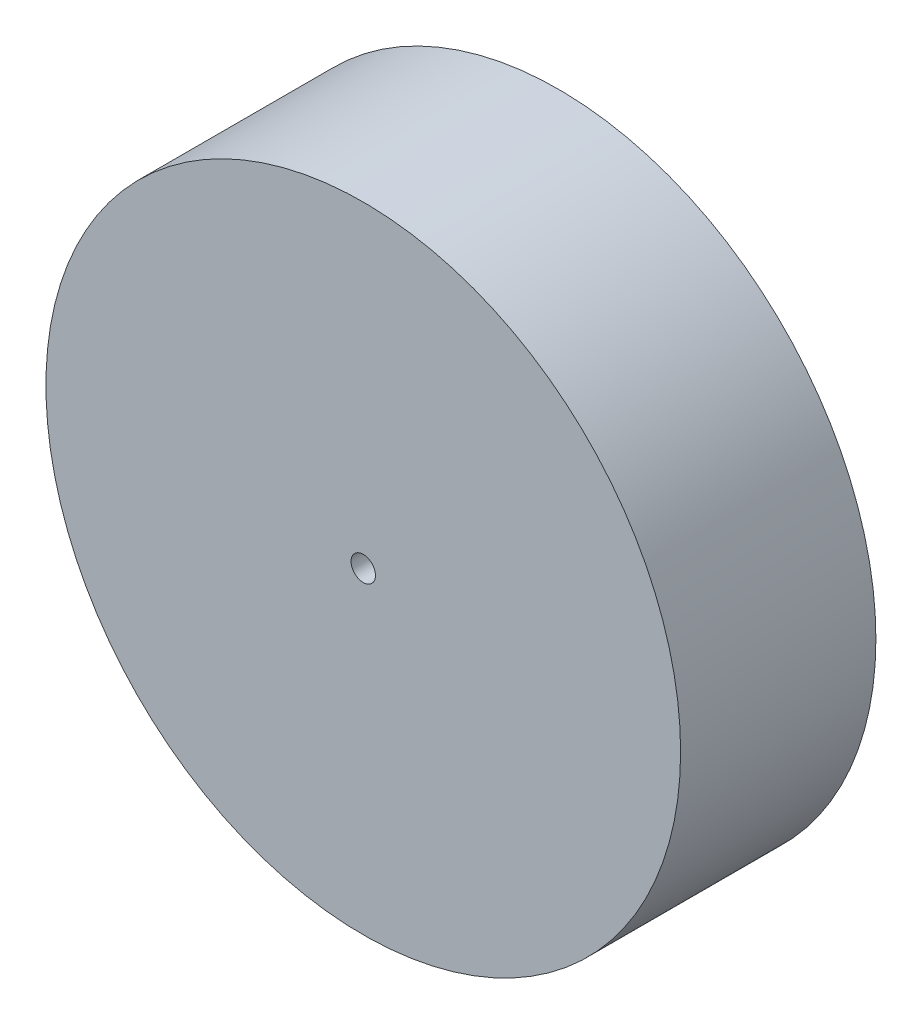
ISO-10303-21;
HEADER;
FILE_DESCRIPTION(('STEP AP214'),'2;1');
FILE_NAME('part.step','',(''),(''),'','','');
FILE_SCHEMA(('AUTOMOTIVE_DESIGN { 1 0 10303 214 1 1 1 1 }'));
ENDSEC;
DATA;
#1=APPLICATION_CONTEXT('core data for automotive mechanical design processes');
#2=APPLICATION_PROTOCOL_DEFINITION('international standard','automotive_design',2000,#1);
#3=PRODUCT_CONTEXT('',#1,'mechanical');
#4=PRODUCT('Part','Part','',(#3));
#5=PRODUCT_RELATED_PRODUCT_CATEGORY('part','',(#4));
#6=PRODUCT_DEFINITION_FORMATION('','',#4);
#7=PRODUCT_DEFINITION_CONTEXT('part definition',#1,'design');
#8=PRODUCT_DEFINITION('design','',#6,#7);
#9=PRODUCT_DEFINITION_SHAPE('','',#8);
#10=(LENGTH_UNIT() NAMED_UNIT(*) SI_UNIT(.MILLI.,.METRE.));
#11=(NAMED_UNIT(*) PLANE_ANGLE_UNIT() SI_UNIT($,.RADIAN.));
#12=(NAMED_UNIT(*) SI_UNIT($,.STERADIAN.) SOLID_ANGLE_UNIT());
#13=UNCERTAINTY_MEASURE_WITH_UNIT(LENGTH_MEASURE(1.E-05),#10,'distance_accuracy_value','');
#14=(GEOMETRIC_REPRESENTATION_CONTEXT(3) GLOBAL_UNCERTAINTY_ASSIGNED_CONTEXT((#13)) GLOBAL_UNIT_ASSIGNED_CONTEXT((#10,
#11,#12)) REPRESENTATION_CONTEXT('',''));
#15=CARTESIAN_POINT('',(0.,0.,0.));
#16=DIRECTION('',(0.,0.,1.));
#17=DIRECTION('',(1.,0.,0.));
#18=AXIS2_PLACEMENT_3D('',#15,#16,#17);
#19=CARTESIAN_POINT('',(0.,0.,40.));
#20=DIRECTION('',(0.,0.,-1.));
#21=DIRECTION('',(-1.,0.,0.));
#22=AXIS2_PLACEMENT_3D('',#19,#20,#21);
#23=CYLINDRICAL_SURFACE('',#22,65.);
#24=CARTESIAN_POINT('',(0.,0.,40.));
#25=DIRECTION('',(0.,0.,1.));
#26=DIRECTION('',(1.,0.,0.));
#27=AXIS2_PLACEMENT_3D('',#24,#25,#26);
#28=CIRCLE('',#27,65.);
#29=CARTESIAN_POINT('',(65.,0.,40.));
#30=VERTEX_POINT('',#29);
#31=EDGE_CURVE('E10',#30,#30,#28,.T.);
#32=ORIENTED_EDGE('',*,*,#31,.F.);
#33=EDGE_LOOP('',(#32));
#34=FACE_BOUND('',#33,.T.);
#35=CARTESIAN_POINT('',(0.,0.,0.));
#36=DIRECTION('',(0.,0.,1.));
#37=DIRECTION('',(1.,0.,0.));
#38=AXIS2_PLACEMENT_3D('',#35,#36,#37);
#39=CIRCLE('',#38,65.);
#40=CARTESIAN_POINT('',(65.,0.,0.));
#41=VERTEX_POINT('',#40);
#42=EDGE_CURVE('E46',#41,#41,#39,.T.);
#43=ORIENTED_EDGE('',*,*,#42,.T.);
#44=EDGE_LOOP('',(#43));
#45=FACE_BOUND('',#44,.T.);
#46=ADVANCED_FACE('F43',(#34,#45),#23,.T.);
#47=CARTESIAN_POINT('',(0.,0.,40.));
#48=DIRECTION('',(0.,0.,1.));
#49=DIRECTION('',(1.,0.,0.));
#50=AXIS2_PLACEMENT_3D('',#47,#48,#49);
#51=PLANE('',#50);
#52=CARTESIAN_POINT('',(0.,0.,40.));
#53=DIRECTION('',(0.,0.,1.));
#54=DIRECTION('',(1.,0.,0.));
#55=AXIS2_PLACEMENT_3D('',#52,#53,#54);
#56=CIRCLE('',#55,2.5);
#57=CARTESIAN_POINT('',(2.5,0.,40.));
#58=VERTEX_POINT('',#57);
#59=EDGE_CURVE('E55',#58,#58,#56,.T.);
#60=ORIENTED_EDGE('',*,*,#59,.F.);
#61=EDGE_LOOP('',(#60));
#62=FACE_BOUND('',#61,.T.);
#63=ORIENTED_EDGE('',*,*,#31,.T.);
#64=EDGE_LOOP('',(#63));
#65=FACE_BOUND('',#64,.T.);
#66=ADVANCED_FACE('F68',(#62,#65),#51,.T.);
#67=CARTESIAN_POINT('',(0.,0.,0.));
#68=DIRECTION('',(0.,0.,1.));
#69=DIRECTION('',(1.,0.,0.));
#70=AXIS2_PLACEMENT_3D('',#67,#68,#69);
#71=PLANE('',#70);
#72=CARTESIAN_POINT('',(0.,0.,0.));
#73=DIRECTION('',(0.,0.,1.));
#74=DIRECTION('',(1.,0.,0.));
#75=AXIS2_PLACEMENT_3D('',#72,#73,#74);
#76=CIRCLE('',#75,2.5);
#77=CARTESIAN_POINT('',(2.5,0.,0.));
#78=VERTEX_POINT('',#77);
#79=EDGE_CURVE('E57',#78,#78,#76,.T.);
#80=ORIENTED_EDGE('',*,*,#79,.T.);
#81=EDGE_LOOP('',(#80));
#82=FACE_BOUND('',#81,.T.);
#83=ORIENTED_EDGE('',*,*,#42,.F.);
#84=EDGE_LOOP('',(#83));
#85=FACE_BOUND('',#84,.T.);
#86=ADVANCED_FACE('F70',(#82,#85),#71,.F.);
#87=CARTESIAN_POINT('',(0.,0.,40.));
#88=DIRECTION('',(0.,0.,-1.));
#89=DIRECTION('',(-1.,0.,0.));
#90=AXIS2_PLACEMENT_3D('',#87,#88,#89);
#91=CYLINDRICAL_SURFACE('',#90,2.5);
#92=ORIENTED_EDGE('',*,*,#59,.T.);
#93=EDGE_LOOP('',(#92));
#94=FACE_BOUND('',#93,.T.);
#95=ORIENTED_EDGE('',*,*,#79,.F.);
#96=EDGE_LOOP('',(#95));
#97=FACE_BOUND('',#96,.T.);
#98=ADVANCED_FACE('F65',(#94,#97),#91,.F.);
#99=CLOSED_SHELL('',(#46,#66,#86,#98));
#100=MANIFOLD_SOLID_BREP('B2',#99);
#101=ADVANCED_BREP_SHAPE_REPRESENTATION('',(#18,#100),#14);
#102=SHAPE_DEFINITION_REPRESENTATION(#9,#101);
ENDSEC;
END-ISO-10303-21;
